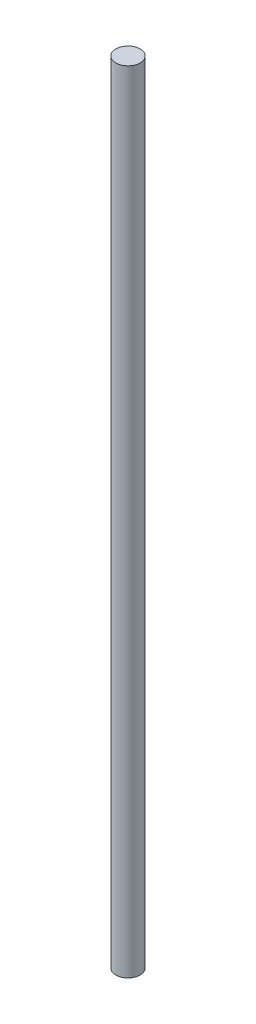
ISO-10303-21;
HEADER;
FILE_DESCRIPTION(('STEP AP214'),'2;1');
FILE_NAME('part.step','',(''),(''),'','','');
FILE_SCHEMA(('AUTOMOTIVE_DESIGN { 1 0 10303 214 1 1 1 1 }'));
ENDSEC;
DATA;
#1=APPLICATION_CONTEXT('core data for automotive mechanical design processes');
#2=APPLICATION_PROTOCOL_DEFINITION('international standard','automotive_design',2000,#1);
#3=PRODUCT_CONTEXT('',#1,'mechanical');
#4=PRODUCT('Part','Part','',(#3));
#5=PRODUCT_RELATED_PRODUCT_CATEGORY('part','',(#4));
#6=PRODUCT_DEFINITION_FORMATION('','',#4);
#7=PRODUCT_DEFINITION_CONTEXT('part definition',#1,'design');
#8=PRODUCT_DEFINITION('design','',#6,#7);
#9=PRODUCT_DEFINITION_SHAPE('','',#8);
#10=(LENGTH_UNIT() NAMED_UNIT(*) SI_UNIT(.MILLI.,.METRE.));
#11=(NAMED_UNIT(*) PLANE_ANGLE_UNIT() SI_UNIT($,.RADIAN.));
#12=(NAMED_UNIT(*) SI_UNIT($,.STERADIAN.) SOLID_ANGLE_UNIT());
#13=UNCERTAINTY_MEASURE_WITH_UNIT(LENGTH_MEASURE(1.E-05),#10,'distance_accuracy_value','');
#14=(GEOMETRIC_REPRESENTATION_CONTEXT(3) GLOBAL_UNCERTAINTY_ASSIGNED_CONTEXT((#13)) GLOBAL_UNIT_ASSIGNED_CONTEXT((#10,
#11,#12)) REPRESENTATION_CONTEXT('',''));
#15=CARTESIAN_POINT('',(0.,0.,0.));
#16=DIRECTION('',(0.,0.,1.));
#17=DIRECTION('',(1.,0.,0.));
#18=AXIS2_PLACEMENT_3D('',#15,#16,#17);
#19=CARTESIAN_POINT('',(0.,260.,0.));
#20=DIRECTION('',(0.,-1.,0.));
#21=DIRECTION('',(0.,0.,-1.));
#22=AXIS2_PLACEMENT_3D('',#19,#20,#21);
#23=CYLINDRICAL_SURFACE('',#22,4.);
#24=CARTESIAN_POINT('',(0.,260.,0.));
#25=DIRECTION('',(0.,1.,0.));
#26=DIRECTION('',(0.,0.,1.));
#27=AXIS2_PLACEMENT_3D('',#24,#25,#26);
#28=CIRCLE('',#27,4.);
#29=CARTESIAN_POINT('',(0.,260.,4.));
#30=VERTEX_POINT('',#29);
#31=EDGE_CURVE('E10',#30,#30,#28,.T.);
#32=ORIENTED_EDGE('',*,*,#31,.F.);
#33=EDGE_LOOP('',(#32));
#34=FACE_BOUND('',#33,.T.);
#35=CARTESIAN_POINT('',(0.,0.,0.));
#36=DIRECTION('',(0.,1.,0.));
#37=DIRECTION('',(0.,0.,1.));
#38=AXIS2_PLACEMENT_3D('',#35,#36,#37);
#39=CIRCLE('',#38,4.);
#40=CARTESIAN_POINT('',(0.,0.,4.));
#41=VERTEX_POINT('',#40);
#42=EDGE_CURVE('E38',#41,#41,#39,.T.);
#43=ORIENTED_EDGE('',*,*,#42,.T.);
#44=EDGE_LOOP('',(#43));
#45=FACE_BOUND('',#44,.T.);
#46=ADVANCED_FACE('F35',(#34,#45),#23,.T.);
#47=CARTESIAN_POINT('',(0.,260.,0.));
#48=DIRECTION('',(0.,1.,0.));
#49=DIRECTION('',(0.,0.,1.));
#50=AXIS2_PLACEMENT_3D('',#47,#48,#49);
#51=PLANE('',#50);
#52=ORIENTED_EDGE('',*,*,#31,.T.);
#53=EDGE_LOOP('',(#52));
#54=FACE_BOUND('',#53,.T.);
#55=ADVANCED_FACE('F50',(#54),#51,.T.);
#56=CARTESIAN_POINT('',(0.,0.,0.));
#57=DIRECTION('',(0.,1.,0.));
#58=DIRECTION('',(0.,0.,1.));
#59=AXIS2_PLACEMENT_3D('',#56,#57,#58);
#60=PLANE('',#59);
#61=ORIENTED_EDGE('',*,*,#42,.F.);
#62=EDGE_LOOP('',(#61));
#63=FACE_BOUND('',#62,.T.);
#64=ADVANCED_FACE('F48',(#63),#60,.F.);
#65=CLOSED_SHELL('',(#46,#55,#64));
#66=MANIFOLD_SOLID_BREP('B2',#65);
#67=ADVANCED_BREP_SHAPE_REPRESENTATION('',(#18,#66),#14);
#68=SHAPE_DEFINITION_REPRESENTATION(#9,#67);
ENDSEC;
END-ISO-10303-21;
